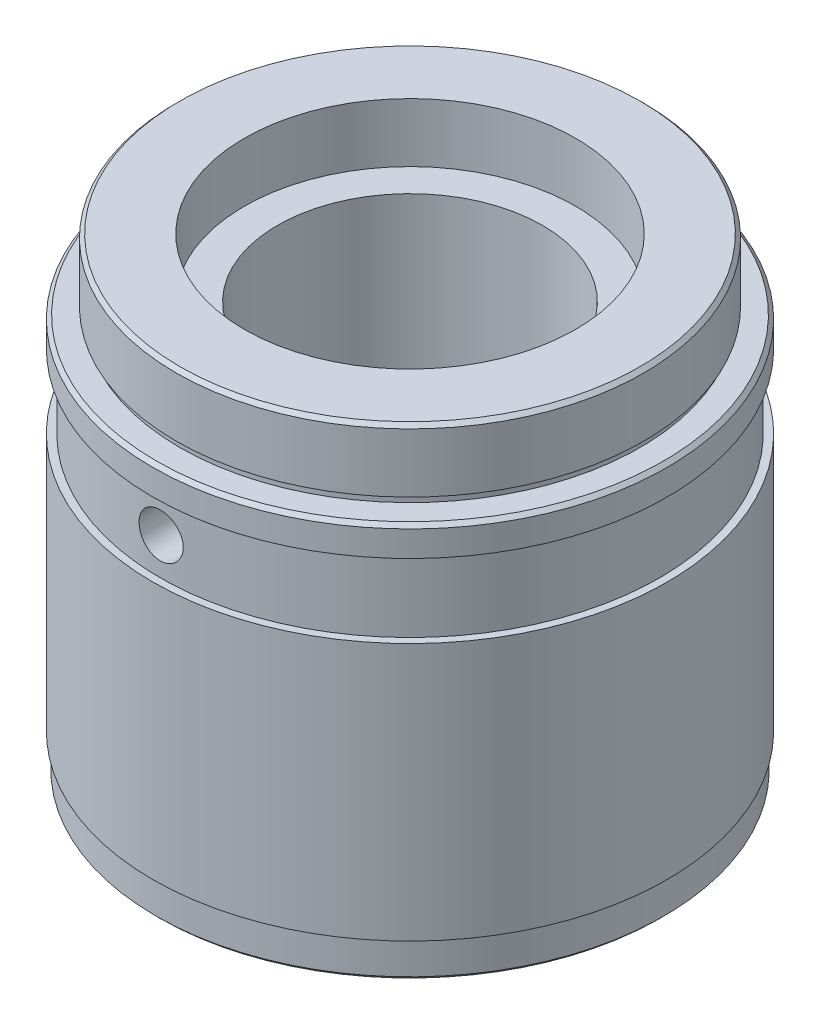
ISO-10303-21;
HEADER;
FILE_DESCRIPTION(('STEP AP214'),'2;1');
FILE_NAME('part.step','',(''),(''),'','','');
FILE_SCHEMA(('AUTOMOTIVE_DESIGN { 1 0 10303 214 1 1 1 1 }'));
ENDSEC;
DATA;
#1=APPLICATION_CONTEXT('core data for automotive mechanical design processes');
#2=APPLICATION_PROTOCOL_DEFINITION('international standard','automotive_design',2000,#1);
#3=PRODUCT_CONTEXT('',#1,'mechanical');
#4=PRODUCT('Part','Part','',(#3));
#5=PRODUCT_RELATED_PRODUCT_CATEGORY('part','',(#4));
#6=PRODUCT_DEFINITION_FORMATION('','',#4);
#7=PRODUCT_DEFINITION_CONTEXT('part definition',#1,'design');
#8=PRODUCT_DEFINITION('design','',#6,#7);
#9=PRODUCT_DEFINITION_SHAPE('','',#8);
#10=(LENGTH_UNIT() NAMED_UNIT(*) SI_UNIT(.MILLI.,.METRE.));
#11=(NAMED_UNIT(*) PLANE_ANGLE_UNIT() SI_UNIT($,.RADIAN.));
#12=(NAMED_UNIT(*) SI_UNIT($,.STERADIAN.) SOLID_ANGLE_UNIT());
#13=UNCERTAINTY_MEASURE_WITH_UNIT(LENGTH_MEASURE(1.E-05),#10,'distance_accuracy_value','');
#14=(GEOMETRIC_REPRESENTATION_CONTEXT(3) GLOBAL_UNCERTAINTY_ASSIGNED_CONTEXT((#13)) GLOBAL_UNIT_ASSIGNED_CONTEXT((#10,
#11,#12)) REPRESENTATION_CONTEXT('',''));
#15=CARTESIAN_POINT('',(0.,0.,0.));
#16=DIRECTION('',(0.,0.,1.));
#17=DIRECTION('',(1.,0.,0.));
#18=AXIS2_PLACEMENT_3D('',#15,#16,#17);
#19=CARTESIAN_POINT('',(0.,63.5,0.));
#20=DIRECTION('',(0.,-1.,0.));
#21=DIRECTION('',(0.,0.,-1.));
#22=AXIS2_PLACEMENT_3D('',#19,#20,#21);
#23=CYLINDRICAL_SURFACE('',#22,18.);
#24=CARTESIAN_POINT('',(0.,55.5,0.));
#25=DIRECTION('',(0.,1.,0.));
#26=DIRECTION('',(0.,0.,1.));
#27=AXIS2_PLACEMENT_3D('',#24,#25,#26);
#28=CIRCLE('',#27,18.);
#29=CARTESIAN_POINT('',(0.,55.5,18.));
#30=VERTEX_POINT('',#29);
#31=EDGE_CURVE('E74',#30,#30,#28,.T.);
#32=ORIENTED_EDGE('',*,*,#31,.T.);
#33=EDGE_LOOP('',(#32));
#34=FACE_BOUND('',#33,.T.);
#35=CARTESIAN_POINT('',(0.,5.,0.));
#36=DIRECTION('',(0.,-1.,0.));
#37=DIRECTION('',(0.,0.,-1.));
#38=AXIS2_PLACEMENT_3D('',#35,#36,#37);
#39=CIRCLE('',#38,18.);
#40=CARTESIAN_POINT('',(0.,5.,-18.));
#41=VERTEX_POINT('',#40);
#42=EDGE_CURVE('E71',#41,#41,#39,.F.);
#43=ORIENTED_EDGE('',*,*,#42,.F.);
#44=EDGE_LOOP('',(#43));
#45=FACE_BOUND('',#44,.T.);
#46=CARTESIAN_POINT('',(-3.,45.,17.7482393492988));
#47=CARTESIAN_POINT('',(-2.99999327810379,45.1672508977942,17.7482423683992));
#48=CARTESIAN_POINT('',(-2.98596620283394,45.3345931272858,17.7506291086228));
#49=CARTESIAN_POINT('',(-2.93025291367965,45.6645822519158,17.7599094864005));
#50=CARTESIAN_POINT('',(-2.88854119237033,45.8272246725097,17.7668072801564));
#51=CARTESIAN_POINT('',(-2.77875545240459,46.1429907400099,17.7843073124077));
#52=CARTESIAN_POINT('',(-2.71070346591838,46.2961222183947,17.7949064542081));
#53=CARTESIAN_POINT('',(-2.55022379626736,46.5887771456613,17.8186112652274));
#54=CARTESIAN_POINT('',(-2.45779885620159,46.7283021234928,17.8317166523308));
#55=CARTESIAN_POINT('',(-2.25022503235985,46.9911754196935,17.8591016538706));
#56=CARTESIAN_POINT('',(-2.13488285871881,47.1143701576635,17.8733906079353));
#57=CARTESIAN_POINT('',(-1.88516640563433,47.3397519682342,17.901449768023));
#58=CARTESIAN_POINT('',(-1.75079099897997,47.4419377957385,17.9152199432608));
#59=CARTESIAN_POINT('',(-1.46582744393803,47.6229774806631,17.9407888437925));
#60=CARTESIAN_POINT('',(-1.31514729774805,47.7016884092782,17.9525753091881));
#61=CARTESIAN_POINT('',(-1.00247474606864,47.8326252846367,17.9727448434851));
#62=CARTESIAN_POINT('',(-0.840483076893825,47.8848529534619,17.9811281336719));
#63=CARTESIAN_POINT('',(-0.51137247161309,47.9608710419807,17.9934808166928));
#64=CARTESIAN_POINT('',(-0.344314664015124,47.9849194992056,17.9974902373309));
#65=CARTESIAN_POINT('',(-0.00849034263095569,48.0046989049831,18.0007809521133));
#66=CARTESIAN_POINT('',(0.160276054234679,48.0004317782967,18.0000625676317));
#67=CARTESIAN_POINT('',(0.492962622094652,47.9639023781661,17.9940103011767));
#68=CARTESIAN_POINT('',(0.656914236840171,47.931917803909,17.9887222043088));
#69=CARTESIAN_POINT('',(0.977090375534151,47.8412987109042,17.9741757452596));
#70=CARTESIAN_POINT('',(1.13331466398181,47.7826633804926,17.9649172621585));
#71=CARTESIAN_POINT('',(1.43442737733918,47.6401312316216,17.9433923821435));
#72=CARTESIAN_POINT('',(1.57926062762286,47.5561199855011,17.9311124079226));
#73=CARTESIAN_POINT('',(1.85287863581597,47.3653046128379,17.904908856858));
#74=CARTESIAN_POINT('',(1.98166209349905,47.258498641547,17.8909851470296));
#75=CARTESIAN_POINT('',(2.221165528136,47.0235854320568,17.8628432187912));
#76=CARTESIAN_POINT('',(2.33164740270385,46.8952354861188,17.8486234767725));
#77=CARTESIAN_POINT('',(2.52954550613768,46.621695491741,17.8216555174177));
#78=CARTESIAN_POINT('',(2.6169615222389,46.4765052879806,17.8089073136559));
#79=CARTESIAN_POINT('',(2.76629332138594,46.173130029747,17.7863250547418));
#80=CARTESIAN_POINT('',(2.82818043273509,46.0149306022895,17.7764942796312));
#81=CARTESIAN_POINT('',(2.92443584497874,45.6901811132309,17.7609142642786));
#82=CARTESIAN_POINT('',(2.95880656892155,45.5236317882811,17.7551646646599));
#83=CARTESIAN_POINT('',(2.99871826185512,45.1890406126054,17.7484675130654));
#84=CARTESIAN_POINT('',(3.00459864949493,45.0210403443575,17.747463429104));
#85=CARTESIAN_POINT('',(2.98826724321895,44.686455993971,17.7502204173883));
#86=CARTESIAN_POINT('',(2.9660565343496,44.5198718573832,17.7539813055822));
#87=CARTESIAN_POINT('',(2.89446280191372,44.193926688971,17.7657922494602));
#88=CARTESIAN_POINT('',(2.84525254877566,44.0345266321464,17.7738150230202));
#89=CARTESIAN_POINT('',(2.72123782823073,43.7262358004646,17.793222876066));
#90=CARTESIAN_POINT('',(2.64643182972112,43.5773456549389,17.8046081566869));
#91=CARTESIAN_POINT('',(2.47254800787507,43.2927904867127,17.8295895407687));
#92=CARTESIAN_POINT('',(2.37325267699123,43.1572601126927,17.8432050672042));
#93=CARTESIAN_POINT('',(2.15350735884957,42.904663760766,17.8710560001584));
#94=CARTESIAN_POINT('',(2.03305588366085,42.7875990826683,17.885291450224));
#95=CARTESIAN_POINT('',(1.77291368439457,42.5740177287256,17.9129570654192));
#96=CARTESIAN_POINT('',(1.63303590406343,42.4777274084585,17.9263773161361));
#97=CARTESIAN_POINT('',(1.33889213753919,42.3100136075941,17.9507413491953));
#98=CARTESIAN_POINT('',(1.18462661696475,42.2385893226314,17.9616852116397));
#99=CARTESIAN_POINT('',(0.866758861801593,42.1229872992542,17.979820298035));
#100=CARTESIAN_POINT('',(0.703200675123134,42.0786911091181,17.9870278148114));
#101=CARTESIAN_POINT('',(0.370836881849055,42.0182212812434,17.9969469980314));
#102=CARTESIAN_POINT('',(0.202031708185944,42.0020453295212,17.9996590344023));
#103=CARTESIAN_POINT('',(-0.133849530928413,41.9983417412254,18.0002764546537));
#104=CARTESIAN_POINT('',(-0.300921792723198,42.0104696952707,17.9982396242903));
#105=CARTESIAN_POINT('',(-0.630614369177646,42.0622847067233,17.989706140648));
#106=CARTESIAN_POINT('',(-0.793234708760976,42.1019716098116,17.9832095123422));
#107=CARTESIAN_POINT('',(-1.10927573510225,42.2076457986524,17.9664838659288));
#108=CARTESIAN_POINT('',(-1.26270644658458,42.2736038018521,17.9562590044905));
#109=CARTESIAN_POINT('',(-1.5563765435786,42.4299095234767,17.9331930825364));
#110=CARTESIAN_POINT('',(-1.69661530334186,42.5202583980749,17.920351898009));
#111=CARTESIAN_POINT('',(-1.96165553463168,42.7240021109526,17.8932915553969));
#112=CARTESIAN_POINT('',(-2.0862617167233,42.8376491457015,17.8790582944934));
#113=CARTESIAN_POINT('',(-2.3147566511411,43.0842339694846,17.8509156397724));
#114=CARTESIAN_POINT('',(-2.41864054405428,43.217176270695,17.8370063225941));
#115=CARTESIAN_POINT('',(-2.60341712509304,43.4996943869875,17.8109801224069));
#116=CARTESIAN_POINT('',(-2.68414198686924,43.6493812077186,17.7988766141494));
#117=CARTESIAN_POINT('',(-2.81917744368512,43.9603310830058,17.7779905210958));
#118=CARTESIAN_POINT('',(-2.87351442626769,44.1215823872128,17.7692046206985));
#119=CARTESIAN_POINT('',(-2.94243126375291,44.4028845233849,17.7578969382779));
#120=CARTESIAN_POINT('',(-2.96398490120566,44.5212321695551,17.7542954810336));
#121=CARTESIAN_POINT('',(-2.99277155421758,44.7597041818043,17.7494656234569));
#122=CARTESIAN_POINT('',(-3.00000482975133,44.879828515589,17.7482371800443));
#123=CARTESIAN_POINT('',(-3.,45.,17.7482393492988));
#124=B_SPLINE_CURVE_WITH_KNOTS('',3,(#46,#47,#48,#49,#50,#51,#52,#53,#54,#55,#56,#57,#58,#59,
#60,#61,#62,#63,#64,#65,#66,#67,#68,#69,#70,#71,#72,#73,#74,#75,#76,#77,#78,#79,#80,#81,#82,#83,
#84,#85,#86,#87,#88,#89,#90,#91,#92,#93,#94,#95,#96,#97,#98,#99,#100,#101,#102,#103,#104,#105,
#106,#107,#108,#109,#110,#111,#112,#113,#114,#115,#116,#117,#118,#119,#120,#121,#122,#123),
.UNSPECIFIED.,.T.,.F.,(4,2,2,2,2,2,2,2,2,2,2,2,2,2,2,2,2,2,2,2,2,2,2,2,2,2,2,2,2,2,2,2,2,2,2,2,
2,2,4),(0.,0.501313246713293,1.00308902395556,1.50444599745023,2.00574656886328,
2.51146990986857,3.01722321401336,3.52599576133722,4.03473522133336,4.53877880967078,
5.0427881358323,5.54180545397602,6.0408379709944,6.54215524967311,7.04351311472117,
7.55095348154548,8.05839852895223,8.56641194998324,9.07438063125692,9.57628250904492,
10.0781650009677,10.5768727756259,11.0756103875229,11.5789481131524,12.0823212531683,
12.5909293564246,13.0995210057204,13.6058758130118,14.1121889509482,14.612373315191,
15.1125548786259,15.6121804779895,16.111829764708,16.617203969559,17.1226965465817,
17.6317647314198,18.1403228009335,18.5005280465252,18.8607267528218),.UNSPECIFIED.);
#125=CARTESIAN_POINT('',(-3.,45.,17.7482393492988));
#126=VERTEX_POINT('',#125);
#127=EDGE_CURVE('E115',#126,#126,#124,.T.);
#128=ORIENTED_EDGE('',*,*,#127,.F.);
#129=EDGE_LOOP('',(#128));
#130=FACE_BOUND('',#129,.T.);
#131=ADVANCED_FACE('F38',(#34,#45,#130),#23,.F.);
#132=CARTESIAN_POINT('',(0.,0.,0.));
#133=DIRECTION('',(0.,-1.,0.));
#134=DIRECTION('',(0.,0.,-1.));
#135=AXIS2_PLACEMENT_3D('',#132,#133,#134);
#136=CYLINDRICAL_SURFACE('',#135,33.925);
#137=CARTESIAN_POINT('',(0.,40.,0.));
#138=DIRECTION('',(0.,-1.,0.));
#139=DIRECTION('',(0.,0.,-1.));
#140=AXIS2_PLACEMENT_3D('',#137,#138,#139);
#141=CIRCLE('',#140,33.925);
#142=CARTESIAN_POINT('',(0.,40.,-33.925));
#143=VERTEX_POINT('',#142);
#144=EDGE_CURVE('E112',#143,#143,#141,.T.);
#145=ORIENTED_EDGE('',*,*,#144,.F.);
#146=EDGE_LOOP('',(#145));
#147=FACE_BOUND('',#146,.T.);
#148=CARTESIAN_POINT('',(0.,50.,0.));
#149=DIRECTION('',(0.,-1.,0.));
#150=DIRECTION('',(0.,0.,-1.));
#151=AXIS2_PLACEMENT_3D('',#148,#149,#150);
#152=CIRCLE('',#151,33.925);
#153=CARTESIAN_POINT('',(0.,50.,-33.925));
#154=VERTEX_POINT('',#153);
#155=EDGE_CURVE('E101',#154,#154,#152,.T.);
#156=ORIENTED_EDGE('',*,*,#155,.T.);
#157=EDGE_LOOP('',(#156));
#158=FACE_BOUND('',#157,.T.);
#159=CARTESIAN_POINT('',(-3.,45.,33.792094119779));
#160=CARTESIAN_POINT('',(-2.99999267107882,44.8318425260384,33.7920958750896));
#161=CARTESIAN_POINT('',(-2.98581395190152,44.6635715159708,33.7933628230733));
#162=CARTESIAN_POINT('',(-2.92946260888164,44.3316880638937,33.7982934899579));
#163=CARTESIAN_POINT('',(-2.88725851459902,44.1680810748843,33.8019599032153));
#164=CARTESIAN_POINT('',(-2.77608897334398,43.8503803175232,33.8112710153805));
#165=CARTESIAN_POINT('',(-2.70713899950319,43.6962811083288,33.816914570282));
#166=CARTESIAN_POINT('',(-2.54446311028519,43.4018789099645,33.8295426562241));
#167=CARTESIAN_POINT('',(-2.4507423837102,43.261573039898,33.8365269063416));
#168=CARTESIAN_POINT('',(-2.24089496515953,42.9983014058007,33.8510719496688));
#169=CARTESIAN_POINT('',(-2.12471173670663,42.8753807801768,33.8586341679119));
#170=CARTESIAN_POINT('',(-1.87335736624703,42.6507569680186,33.87347006243));
#171=CARTESIAN_POINT('',(-1.7381853840144,42.549054720863,33.8807437259186));
#172=CARTESIAN_POINT('',(-1.45241884281413,42.3696024704325,33.8941966622507));
#173=CARTESIAN_POINT('',(-1.3017994749543,42.2918918269081,33.9003741297306));
#174=CARTESIAN_POINT('',(-0.989586504955403,42.1628804689191,33.9109232350728));
#175=CARTESIAN_POINT('',(-0.827993116542124,42.1115792402819,33.9152949080923));
#176=CARTESIAN_POINT('',(-0.498870820724778,42.0369737343713,33.9217298818751));
#177=CARTESIAN_POINT('',(-0.331358675862562,42.0135960394069,33.923799235004));
#178=CARTESIAN_POINT('',(0.00522365226317945,41.9952741884695,33.9254169428322));
#179=CARTESIAN_POINT('',(0.174293803202619,42.0003294439156,33.9249653497168));
#180=CARTESIAN_POINT('',(0.508694883373913,42.038670080504,33.9215970290651));
#181=CARTESIAN_POINT('',(0.674034943486483,42.0718765135294,33.918687195581));
#182=CARTESIAN_POINT('',(0.996785579652646,42.1654540720867,33.9107375313264));
#183=CARTESIAN_POINT('',(1.15419607222598,42.2258254835375,33.9056976781368));
#184=CARTESIAN_POINT('',(1.45686981207262,42.3721068564501,33.8940429929383));
#185=CARTESIAN_POINT('',(1.60211594271208,42.4580520543477,33.8874259903989));
#186=CARTESIAN_POINT('',(1.87615114941376,42.6530157477283,33.8733602952539));
#187=CARTESIAN_POINT('',(2.00493984883599,42.7620347711206,33.8659115836215));
#188=CARTESIAN_POINT('',(2.2428661894824,43.0004961509475,33.8509891447348));
#189=CARTESIAN_POINT('',(2.35193506508977,43.1300071304929,33.8435154191167));
#190=CARTESIAN_POINT('',(2.54679410664365,43.4055372842803,33.8294108699737));
#191=CARTESIAN_POINT('',(2.63258424969906,43.5515564747555,33.8227800472776));
#192=CARTESIAN_POINT('',(2.7784485955739,43.8560076923412,33.8111110396287));
#193=CARTESIAN_POINT('',(2.83851903515919,44.0144415319188,33.8060730877683));
#194=CARTESIAN_POINT('',(2.93118688040994,44.3392007767151,33.7981648984131));
#195=CARTESIAN_POINT('',(2.96378493761287,44.5055259946824,33.7952946095098));
#196=CARTESIAN_POINT('',(3.00049522444766,44.8407443427346,33.7920552579502));
#197=CARTESIAN_POINT('',(3.00470343695953,45.0096268835481,33.7916777675135));
#198=CARTESIAN_POINT('',(2.98476618998442,45.3456949254165,33.7934445127532));
#199=CARTESIAN_POINT('',(2.96062102884864,45.5128804443097,33.7955887218946));
#200=CARTESIAN_POINT('',(2.88474252718675,45.8405318983231,33.8021495905304));
#201=CARTESIAN_POINT('',(2.83305414903626,46.0010083264328,33.8065625460428));
#202=CARTESIAN_POINT('',(2.70360222028153,46.3110116233384,33.8171606306904));
#203=CARTESIAN_POINT('',(2.62583819961237,46.4605382946841,33.8233457917728));
#204=CARTESIAN_POINT('',(2.44620024148889,46.7448362939522,33.836811804452));
#205=CARTESIAN_POINT('',(2.34426244540381,46.8795671332012,33.8440955392217));
#206=CARTESIAN_POINT('',(2.11926260272777,47.1300393493282,33.8589283530988));
#207=CARTESIAN_POINT('',(1.9962001471289,47.2457803584473,33.8664774373416));
#208=CARTESIAN_POINT('',(1.7320290370858,47.4553160420481,33.8810155575946));
#209=CARTESIAN_POINT('',(1.59087075806447,47.5490482812362,33.8880029642015));
#210=CARTESIAN_POINT('',(1.29476160648307,47.7114769640883,33.9006068892752));
#211=CARTESIAN_POINT('',(1.13981088662934,47.7801736848963,33.9062234229172));
#212=CARTESIAN_POINT('',(0.82073739789224,47.890474468808,33.9154453160321));
#213=CARTESIAN_POINT('',(0.65662797203734,47.9321168825279,33.9190535213499));
#214=CARTESIAN_POINT('',(0.323713216453853,47.9872522691813,33.9238638035708));
#215=CARTESIAN_POINT('',(0.154907988019935,48.0007458488459,33.9250659323355));
#216=CARTESIAN_POINT('',(-0.181991812769945,47.9991930501547,33.9249286644311));
#217=CARTESIAN_POINT('',(-0.350086845140443,47.98424386446,33.9235979229062));
#218=CARTESIAN_POINT('',(-0.68136857717986,47.926432891358,33.9185615335335));
#219=CARTESIAN_POINT('',(-0.844555270903595,47.8835710701431,33.9148558828091));
#220=CARTESIAN_POINT('',(-1.16139227841753,47.7711768843979,33.9054852725262));
#221=CARTESIAN_POINT('',(-1.31504333290692,47.7016465944126,33.8998204653741));
#222=CARTESIAN_POINT('',(-1.60850779229126,47.5379000289454,33.8871646337675));
#223=CARTESIAN_POINT('',(-1.74832137616468,47.4436840728138,33.8801736264699));
#224=CARTESIAN_POINT('',(-2.01063987203437,47.2328756287799,33.8656211561313));
#225=CARTESIAN_POINT('',(-2.13308673533634,47.1162110316037,33.8580579037695));
#226=CARTESIAN_POINT('',(-2.35671333273557,46.8639516972827,33.8432286081484));
#227=CARTESIAN_POINT('',(-2.45788792334432,46.7283523950163,33.835962637111));
#228=CARTESIAN_POINT('',(-2.63625352030318,46.4417774318368,33.8225344131161));
#229=CARTESIAN_POINT('',(-2.71339463734521,46.2907706383958,33.8163744671504));
#230=CARTESIAN_POINT('',(-2.84112653048197,45.9779943788743,33.805883663896));
#231=CARTESIAN_POINT('',(-2.89174766612035,45.8162374595265,33.8015507162105));
#232=CARTESIAN_POINT('',(-2.95218692908899,45.5446141501346,33.7963126761087));
#233=CARTESIAN_POINT('',(-2.9700928058527,45.4364918602575,33.7947380491837));
#234=CARTESIAN_POINT('',(-2.99400170882891,45.2189290884048,33.7926282011808));
#235=CARTESIAN_POINT('',(-3.00000477191634,45.1094886105142,33.7920929768829));
#236=CARTESIAN_POINT('',(-3.,45.,33.792094119779));
#237=B_SPLINE_CURVE_WITH_KNOTS('',3,(#159,#160,#161,#162,#163,#164,#165,#166,#167,#168,#169,
#170,#171,#172,#173,#174,#175,#176,#177,#178,#179,#180,#181,#182,#183,#184,#185,#186,#187,#188,
#189,#190,#191,#192,#193,#194,#195,#196,#197,#198,#199,#200,#201,#202,#203,#204,#205,#206,#207,
#208,#209,#210,#211,#212,#213,#214,#215,#216,#217,#218,#219,#220,#221,#222,#223,#224,#225,#226,
#227,#228,#229,#230,#231,#232,#233,#234,#235,#236),.UNSPECIFIED.,.T.,.F.,(4,2,2,2,2,2,2,2,2,2,2,
2,2,2,2,2,2,2,2,2,2,2,2,2,2,2,2,2,2,2,2,2,2,2,2,2,2,2,4),(0.,0.504072638880859,1.00871227371218,
1.51306039680299,2.01730295622866,2.52283157987454,3.02838257950828,3.53475861364688,
4.04112478862794,4.54615665366862,5.05117806425483,5.5547878430664,6.05840292263289,
6.56271513888678,7.06703889461725,7.57308873040358,8.07913906381145,8.585263415788,
9.09137576413647,9.5957761421185,10.100171212545,10.6037454044419,11.1073286747457,
11.6122573524093,12.1171958074196,12.6235498364946,13.1298982600456,13.6355273382192,
14.1411455177501,14.6450390361393,15.1489331648408,15.652788103476,16.1566365242306,
16.6621312664192,17.1677480935389,17.6744076057225,18.1804858297892,18.5086923763623,
18.8368979061499),.UNSPECIFIED.);
#238=CARTESIAN_POINT('',(-3.,45.,33.792094119779));
#239=VERTEX_POINT('',#238);
#240=EDGE_CURVE('E43',#239,#239,#237,.T.);
#241=ORIENTED_EDGE('',*,*,#240,.F.);
#242=EDGE_LOOP('',(#241));
#243=FACE_BOUND('',#242,.T.);
#244=ADVANCED_FACE('F137',(#147,#158,#243),#136,.T.);
#245=CARTESIAN_POINT('',(0.,63.5,0.));
#246=DIRECTION('',(0.,-1.,0.));
#247=DIRECTION('',(0.,0.,-1.));
#248=AXIS2_PLACEMENT_3D('',#245,#246,#247);
#249=CYLINDRICAL_SURFACE('',#248,34.925);
#250=CARTESIAN_POINT('',(0.,50.,0.));
#251=DIRECTION('',(0.,-1.,0.));
#252=DIRECTION('',(0.,0.,-1.));
#253=AXIS2_PLACEMENT_3D('',#250,#251,#252);
#254=CIRCLE('',#253,34.925);
#255=CARTESIAN_POINT('',(0.,50.,-34.925));
#256=VERTEX_POINT('',#255);
#257=EDGE_CURVE('E106',#256,#256,#254,.T.);
#258=ORIENTED_EDGE('',*,*,#257,.F.);
#259=EDGE_LOOP('',(#258));
#260=FACE_BOUND('',#259,.T.);
#261=CARTESIAN_POINT('',(0.,53.4800001133974,0.));
#262=DIRECTION('',(0.,1.,0.));
#263=DIRECTION('',(0.,0.,1.));
#264=AXIS2_PLACEMENT_3D('',#261,#262,#263);
#265=CIRCLE('',#264,34.925);
#266=CARTESIAN_POINT('',(0.,53.4800001133974,34.925));
#267=VERTEX_POINT('',#266);
#268=EDGE_CURVE('E11',#267,#267,#265,.F.);
#269=ORIENTED_EDGE('',*,*,#268,.T.);
#270=EDGE_LOOP('',(#269));
#271=FACE_BOUND('',#270,.T.);
#272=ADVANCED_FACE('F141',(#260,#271),#249,.T.);
#273=CARTESIAN_POINT('',(0.,40.,0.));
#274=DIRECTION('',(0.,-1.,0.));
#275=DIRECTION('',(0.,0.,-1.));
#276=AXIS2_PLACEMENT_3D('',#273,#274,#275);
#277=CIRCLE('',#276,34.925);
#278=CARTESIAN_POINT('',(0.,40.,-34.925));
#279=VERTEX_POINT('',#278);
#280=EDGE_CURVE('E109',#279,#279,#277,.T.);
#281=ORIENTED_EDGE('',*,*,#280,.T.);
#282=EDGE_LOOP('',(#281));
#283=FACE_BOUND('',#282,.T.);
#284=CARTESIAN_POINT('',(0.,5.,0.));
#285=DIRECTION('',(0.,-1.,0.));
#286=DIRECTION('',(0.,0.,-1.));
#287=AXIS2_PLACEMENT_3D('',#284,#285,#286);
#288=CIRCLE('',#287,34.925);
#289=CARTESIAN_POINT('',(0.,5.,-34.925));
#290=VERTEX_POINT('',#289);
#291=EDGE_CURVE('E70',#290,#290,#288,.T.);
#292=ORIENTED_EDGE('',*,*,#291,.F.);
#293=EDGE_LOOP('',(#292));
#294=FACE_BOUND('',#293,.T.);
#295=ADVANCED_FACE('F206',(#283,#294),#249,.T.);
#296=CARTESIAN_POINT('',(0.,5.,0.));
#297=DIRECTION('',(0.,-1.,0.));
#298=DIRECTION('',(0.,0.,-1.));
#299=AXIS2_PLACEMENT_3D('',#296,#297,#298);
#300=PLANE('',#299);
#301=CARTESIAN_POINT('',(0.,5.,0.));
#302=DIRECTION('',(0.,-1.,0.));
#303=DIRECTION('',(0.,0.,-1.));
#304=AXIS2_PLACEMENT_3D('',#301,#302,#303);
#305=CIRCLE('',#304,34.5);
#306=CARTESIAN_POINT('',(0.,5.,-34.5));
#307=VERTEX_POINT('',#306);
#308=EDGE_CURVE('E82',#307,#307,#305,.T.);
#309=ORIENTED_EDGE('',*,*,#308,.F.);
#310=EDGE_LOOP('',(#309));
#311=FACE_BOUND('',#310,.T.);
#312=ORIENTED_EDGE('',*,*,#291,.T.);
#313=EDGE_LOOP('',(#312));
#314=FACE_BOUND('',#313,.T.);
#315=ADVANCED_FACE('F198',(#311,#314),#300,.T.);
#316=CARTESIAN_POINT('',(0.,5.,0.));
#317=DIRECTION('',(0.,-1.,0.));
#318=DIRECTION('',(0.,0.,-1.));
#319=AXIS2_PLACEMENT_3D('',#316,#317,#318);
#320=CYLINDRICAL_SURFACE('',#319,34.5);
#321=CARTESIAN_POINT('',(0.,0.499999886602542,0.));
#322=DIRECTION('',(0.,1.,0.));
#323=DIRECTION('',(0.,0.,1.));
#324=AXIS2_PLACEMENT_3D('',#321,#322,#323);
#325=CIRCLE('',#324,34.5);
#326=CARTESIAN_POINT('',(0.,0.499999886602542,34.5));
#327=VERTEX_POINT('',#326);
#328=EDGE_CURVE('E64',#327,#327,#325,.T.);
#329=ORIENTED_EDGE('',*,*,#328,.T.);
#330=EDGE_LOOP('',(#329));
#331=FACE_BOUND('',#330,.T.);
#332=ORIENTED_EDGE('',*,*,#308,.T.);
#333=EDGE_LOOP('',(#332));
#334=FACE_BOUND('',#333,.T.);
#335=ADVANCED_FACE('F204',(#331,#334),#320,.T.);
#336=CARTESIAN_POINT('',(0.,0.,0.));
#337=DIRECTION('',(0.,1.,0.));
#338=DIRECTION('',(0.,0.,1.));
#339=AXIS2_PLACEMENT_3D('',#336,#337,#338);
#340=PLANE('',#339);
#341=CARTESIAN_POINT('',(0.,0.,0.));
#342=DIRECTION('',(0.,1.,0.));
#343=DIRECTION('',(0.,0.,1.));
#344=AXIS2_PLACEMENT_3D('',#341,#342,#343);
#345=CIRCLE('',#344,34.);
#346=CARTESIAN_POINT('',(0.,0.,34.));
#347=VERTEX_POINT('',#346);
#348=EDGE_CURVE('E67',#347,#347,#345,.F.);
#349=ORIENTED_EDGE('',*,*,#348,.T.);
#350=EDGE_LOOP('',(#349));
#351=FACE_BOUND('',#350,.T.);
#352=CARTESIAN_POINT('',(0.,0.,0.));
#353=DIRECTION('',(0.,-1.,0.));
#354=DIRECTION('',(0.,0.,-1.));
#355=AXIS2_PLACEMENT_3D('',#352,#353,#354);
#356=CIRCLE('',#355,21.);
#357=CARTESIAN_POINT('',(0.,0.,-21.));
#358=VERTEX_POINT('',#357);
#359=EDGE_CURVE('E98',#358,#358,#356,.T.);
#360=ORIENTED_EDGE('',*,*,#359,.F.);
#361=EDGE_LOOP('',(#360));
#362=FACE_BOUND('',#361,.T.);
#363=ADVANCED_FACE('F200',(#351,#362),#340,.F.);
#364=CARTESIAN_POINT('',(0.,53.98,0.));
#365=DIRECTION('',(0.,1.,0.));
#366=DIRECTION('',(0.,0.,1.));
#367=AXIS2_PLACEMENT_3D('',#364,#365,#366);
#368=PLANE('',#367);
#369=CARTESIAN_POINT('',(0.,53.98,0.));
#370=DIRECTION('',(0.,1.,0.));
#371=DIRECTION('',(0.,0.,1.));
#372=AXIS2_PLACEMENT_3D('',#369,#370,#371);
#373=CIRCLE('',#372,34.425);
#374=CARTESIAN_POINT('',(0.,53.98,34.425));
#375=VERTEX_POINT('',#374);
#376=EDGE_CURVE('E52',#375,#375,#373,.T.);
#377=ORIENTED_EDGE('',*,*,#376,.T.);
#378=EDGE_LOOP('',(#377));
#379=FACE_BOUND('',#378,.T.);
#380=CARTESIAN_POINT('',(0.,53.98,0.));
#381=DIRECTION('',(0.,1.,0.));
#382=DIRECTION('',(0.,0.,1.));
#383=AXIS2_PLACEMENT_3D('',#380,#381,#382);
#384=CIRCLE('',#383,31.25);
#385=CARTESIAN_POINT('',(0.,53.98,31.25));
#386=VERTEX_POINT('',#385);
#387=EDGE_CURVE('E88',#386,#386,#384,.T.);
#388=ORIENTED_EDGE('',*,*,#387,.F.);
#389=EDGE_LOOP('',(#388));
#390=FACE_BOUND('',#389,.T.);
#391=ADVANCED_FACE('F203',(#379,#390),#368,.T.);
#392=CARTESIAN_POINT('',(0.,54.98,0.));
#393=DIRECTION('',(0.,1.,0.));
#394=DIRECTION('',(0.,0.,1.));
#395=AXIS2_PLACEMENT_3D('',#392,#393,#394);
#396=PLANE('',#395);
#397=CARTESIAN_POINT('',(0.,54.98,0.));
#398=DIRECTION('',(0.,1.,0.));
#399=DIRECTION('',(0.,0.,1.));
#400=AXIS2_PLACEMENT_3D('',#397,#398,#399);
#401=CIRCLE('',#400,31.75);
#402=CARTESIAN_POINT('',(0.,54.98,31.75));
#403=VERTEX_POINT('',#402);
#404=EDGE_CURVE('E79',#403,#403,#401,.F.);
#405=ORIENTED_EDGE('',*,*,#404,.T.);
#406=EDGE_LOOP('',(#405));
#407=FACE_BOUND('',#406,.T.);
#408=CARTESIAN_POINT('',(0.,54.98,0.));
#409=DIRECTION('',(0.,1.,0.));
#410=DIRECTION('',(0.,0.,1.));
#411=AXIS2_PLACEMENT_3D('',#408,#409,#410);
#412=CIRCLE('',#411,31.25);
#413=CARTESIAN_POINT('',(0.,54.98,31.25));
#414=VERTEX_POINT('',#413);
#415=EDGE_CURVE('E83',#414,#414,#412,.T.);
#416=ORIENTED_EDGE('',*,*,#415,.T.);
#417=EDGE_LOOP('',(#416));
#418=FACE_BOUND('',#417,.T.);
#419=ADVANCED_FACE('F193',(#407,#418),#396,.F.);
#420=CARTESIAN_POINT('',(0.,54.98,0.));
#421=DIRECTION('',(0.,-1.,0.));
#422=DIRECTION('',(0.,0.,-1.));
#423=AXIS2_PLACEMENT_3D('',#420,#421,#422);
#424=CYLINDRICAL_SURFACE('',#423,31.25);
#425=ORIENTED_EDGE('',*,*,#415,.F.);
#426=EDGE_LOOP('',(#425));
#427=FACE_BOUND('',#426,.T.);
#428=ORIENTED_EDGE('',*,*,#387,.T.);
#429=EDGE_LOOP('',(#428));
#430=FACE_BOUND('',#429,.T.);
#431=ADVANCED_FACE('F184',(#427,#430),#424,.T.);
#432=CARTESIAN_POINT('',(0.,63.5,0.));
#433=DIRECTION('',(0.,1.,0.));
#434=DIRECTION('',(0.,0.,1.));
#435=AXIS2_PLACEMENT_3D('',#432,#433,#434);
#436=PLANE('',#435);
#437=CARTESIAN_POINT('',(0.,63.5,0.));
#438=DIRECTION('',(0.,1.,0.));
#439=DIRECTION('',(0.,0.,1.));
#440=AXIS2_PLACEMENT_3D('',#437,#438,#439);
#441=CIRCLE('',#440,31.25);
#442=CARTESIAN_POINT('',(0.,63.5,31.25));
#443=VERTEX_POINT('',#442);
#444=EDGE_CURVE('E61',#443,#443,#441,.T.);
#445=ORIENTED_EDGE('',*,*,#444,.T.);
#446=EDGE_LOOP('',(#445));
#447=FACE_BOUND('',#446,.T.);
#448=CARTESIAN_POINT('',(0.,63.5,0.));
#449=DIRECTION('',(0.,1.,0.));
#450=DIRECTION('',(0.,0.,1.));
#451=AXIS2_PLACEMENT_3D('',#448,#449,#450);
#452=CIRCLE('',#451,22.5);
#453=CARTESIAN_POINT('',(0.,63.5,22.5));
#454=VERTEX_POINT('',#453);
#455=EDGE_CURVE('E78',#454,#454,#452,.T.);
#456=ORIENTED_EDGE('',*,*,#455,.F.);
#457=EDGE_LOOP('',(#456));
#458=FACE_BOUND('',#457,.T.);
#459=ADVANCED_FACE('F182',(#447,#458),#436,.T.);
#460=CARTESIAN_POINT('',(0.,53.98,0.));
#461=DIRECTION('',(0.,1.,0.));
#462=DIRECTION('',(0.,0.,1.));
#463=AXIS2_PLACEMENT_3D('',#460,#461,#462);
#464=CYLINDRICAL_SURFACE('',#463,31.75);
#465=CARTESIAN_POINT('',(0.,63.0000001133975,0.));
#466=DIRECTION('',(0.,1.,0.));
#467=DIRECTION('',(0.,0.,1.));
#468=AXIS2_PLACEMENT_3D('',#465,#466,#467);
#469=CIRCLE('',#468,31.75);
#470=CARTESIAN_POINT('',(0.,63.0000001133975,31.75));
#471=VERTEX_POINT('',#470);
#472=EDGE_CURVE('E56',#471,#471,#469,.F.);
#473=ORIENTED_EDGE('',*,*,#472,.T.);
#474=EDGE_LOOP('',(#473));
#475=FACE_BOUND('',#474,.T.);
#476=ORIENTED_EDGE('',*,*,#404,.F.);
#477=EDGE_LOOP('',(#476));
#478=FACE_BOUND('',#477,.T.);
#479=ADVANCED_FACE('F178',(#475,#478),#464,.T.);
#480=CARTESIAN_POINT('',(0.,55.5,0.));
#481=DIRECTION('',(0.,1.,0.));
#482=DIRECTION('',(0.,0.,1.));
#483=AXIS2_PLACEMENT_3D('',#480,#481,#482);
#484=CYLINDRICAL_SURFACE('',#483,22.5);
#485=CARTESIAN_POINT('',(0.,55.5,0.));
#486=DIRECTION('',(0.,1.,0.));
#487=DIRECTION('',(0.,0.,1.));
#488=AXIS2_PLACEMENT_3D('',#485,#486,#487);
#489=CIRCLE('',#488,22.5);
#490=CARTESIAN_POINT('',(0.,55.5,22.5));
#491=VERTEX_POINT('',#490);
#492=EDGE_CURVE('E91',#491,#491,#489,.T.);
#493=ORIENTED_EDGE('',*,*,#492,.F.);
#494=EDGE_LOOP('',(#493));
#495=FACE_BOUND('',#494,.T.);
#496=ORIENTED_EDGE('',*,*,#455,.T.);
#497=EDGE_LOOP('',(#496));
#498=FACE_BOUND('',#497,.T.);
#499=ADVANCED_FACE('F173',(#495,#498),#484,.F.);
#500=CARTESIAN_POINT('',(0.,55.5,0.));
#501=DIRECTION('',(0.,1.,0.));
#502=DIRECTION('',(0.,0.,1.));
#503=AXIS2_PLACEMENT_3D('',#500,#501,#502);
#504=PLANE('',#503);
#505=ORIENTED_EDGE('',*,*,#31,.F.);
#506=EDGE_LOOP('',(#505));
#507=FACE_BOUND('',#506,.T.);
#508=ORIENTED_EDGE('',*,*,#492,.T.);
#509=EDGE_LOOP('',(#508));
#510=FACE_BOUND('',#509,.T.);
#511=ADVANCED_FACE('F146',(#507,#510),#504,.T.);
#512=CARTESIAN_POINT('',(0.,5.,0.));
#513=DIRECTION('',(0.,-1.,0.));
#514=DIRECTION('',(0.,0.,-1.));
#515=AXIS2_PLACEMENT_3D('',#512,#513,#514);
#516=PLANE('',#515);
#517=CARTESIAN_POINT('',(0.,5.,0.));
#518=DIRECTION('',(0.,-1.,0.));
#519=DIRECTION('',(0.,0.,-1.));
#520=AXIS2_PLACEMENT_3D('',#517,#518,#519);
#521=CIRCLE('',#520,21.);
#522=CARTESIAN_POINT('',(0.,5.,-21.));
#523=VERTEX_POINT('',#522);
#524=EDGE_CURVE('E75',#523,#523,#521,.T.);
#525=ORIENTED_EDGE('',*,*,#524,.T.);
#526=EDGE_LOOP('',(#525));
#527=FACE_BOUND('',#526,.T.);
#528=ORIENTED_EDGE('',*,*,#42,.T.);
#529=EDGE_LOOP('',(#528));
#530=FACE_BOUND('',#529,.T.);
#531=ADVANCED_FACE('F143',(#527,#530),#516,.T.);
#532=CARTESIAN_POINT('',(0.,5.,0.));
#533=DIRECTION('',(0.,-1.,0.));
#534=DIRECTION('',(0.,0.,-1.));
#535=AXIS2_PLACEMENT_3D('',#532,#533,#534);
#536=CYLINDRICAL_SURFACE('',#535,21.);
#537=ORIENTED_EDGE('',*,*,#524,.F.);
#538=EDGE_LOOP('',(#537));
#539=FACE_BOUND('',#538,.T.);
#540=ORIENTED_EDGE('',*,*,#359,.T.);
#541=EDGE_LOOP('',(#540));
#542=FACE_BOUND('',#541,.T.);
#543=ADVANCED_FACE('F145',(#539,#542),#536,.F.);
#544=CARTESIAN_POINT('',(0.,0.,0.));
#545=DIRECTION('',(0.,1.,0.));
#546=DIRECTION('',(0.,0.,1.));
#547=AXIS2_PLACEMENT_3D('',#544,#545,#546);
#548=CONICAL_SURFACE('',#547,34.,0.785398276794898);
#549=ORIENTED_EDGE('',*,*,#328,.F.);
#550=EDGE_LOOP('',(#549));
#551=FACE_BOUND('',#550,.T.);
#552=ORIENTED_EDGE('',*,*,#348,.F.);
#553=EDGE_LOOP('',(#552));
#554=FACE_BOUND('',#553,.T.);
#555=ADVANCED_FACE('F149',(#551,#554),#548,.T.);
#556=CARTESIAN_POINT('',(0.,63.5,0.));
#557=DIRECTION('',(0.,-1.,0.));
#558=DIRECTION('',(0.,0.,-1.));
#559=AXIS2_PLACEMENT_3D('',#556,#557,#558);
#560=CONICAL_SURFACE('',#559,31.25,0.785398276794912);
#561=ORIENTED_EDGE('',*,*,#472,.F.);
#562=EDGE_LOOP('',(#561));
#563=FACE_BOUND('',#562,.T.);
#564=ORIENTED_EDGE('',*,*,#444,.F.);
#565=EDGE_LOOP('',(#564));
#566=FACE_BOUND('',#565,.T.);
#567=ADVANCED_FACE('F154',(#563,#566),#560,.T.);
#568=CARTESIAN_POINT('',(0.,53.98,0.));
#569=DIRECTION('',(0.,-1.,0.));
#570=DIRECTION('',(0.,0.,-1.));
#571=AXIS2_PLACEMENT_3D('',#568,#569,#570);
#572=CONICAL_SURFACE('',#571,34.425,0.785398276794898);
#573=ORIENTED_EDGE('',*,*,#268,.F.);
#574=EDGE_LOOP('',(#573));
#575=FACE_BOUND('',#574,.T.);
#576=ORIENTED_EDGE('',*,*,#376,.F.);
#577=EDGE_LOOP('',(#576));
#578=FACE_BOUND('',#577,.T.);
#579=ADVANCED_FACE('F41',(#575,#578),#572,.T.);
#580=CARTESIAN_POINT('',(33.925,50.,0.));
#581=DIRECTION('',(0.,1.,0.));
#582=DIRECTION('',(0.,0.,1.));
#583=AXIS2_PLACEMENT_3D('',#580,#581,#582);
#584=PLANE('',#583);
#585=ORIENTED_EDGE('',*,*,#155,.F.);
#586=EDGE_LOOP('',(#585));
#587=FACE_BOUND('',#586,.T.);
#588=ORIENTED_EDGE('',*,*,#257,.T.);
#589=EDGE_LOOP('',(#588));
#590=FACE_BOUND('',#589,.T.);
#591=ADVANCED_FACE('F133',(#587,#590),#584,.F.);
#592=CARTESIAN_POINT('',(33.925,40.,0.));
#593=DIRECTION('',(0.,-1.,0.));
#594=DIRECTION('',(0.,0.,-1.));
#595=AXIS2_PLACEMENT_3D('',#592,#593,#594);
#596=PLANE('',#595);
#597=ORIENTED_EDGE('',*,*,#280,.F.);
#598=EDGE_LOOP('',(#597));
#599=FACE_BOUND('',#598,.T.);
#600=ORIENTED_EDGE('',*,*,#144,.T.);
#601=EDGE_LOOP('',(#600));
#602=FACE_BOUND('',#601,.T.);
#603=ADVANCED_FACE('F128',(#599,#602),#596,.F.);
#604=CARTESIAN_POINT('',(0.,45.,34.925));
#605=DIRECTION('',(0.,0.,-1.));
#606=DIRECTION('',(-1.,0.,0.));
#607=AXIS2_PLACEMENT_3D('',#604,#605,#606);
#608=CYLINDRICAL_SURFACE('',#607,3.);
#609=ORIENTED_EDGE('',*,*,#240,.T.);
#610=EDGE_LOOP('',(#609));
#611=FACE_BOUND('',#610,.T.);
#612=ORIENTED_EDGE('',*,*,#127,.T.);
#613=EDGE_LOOP('',(#612));
#614=FACE_BOUND('',#613,.T.);
#615=ADVANCED_FACE('F124',(#611,#614),#608,.F.);
#616=CLOSED_SHELL('',(#131,#244,#272,#295,#315,#335,#363,#391,#419,#431,#459,#479,#499,#511,
#531,#543,#555,#567,#579,#591,#603,#615));
#617=MANIFOLD_SOLID_BREP('B2',#616);
#618=ADVANCED_BREP_SHAPE_REPRESENTATION('',(#18,#617),#14);
#619=SHAPE_DEFINITION_REPRESENTATION(#9,#618);
ENDSEC;
END-ISO-10303-21;
